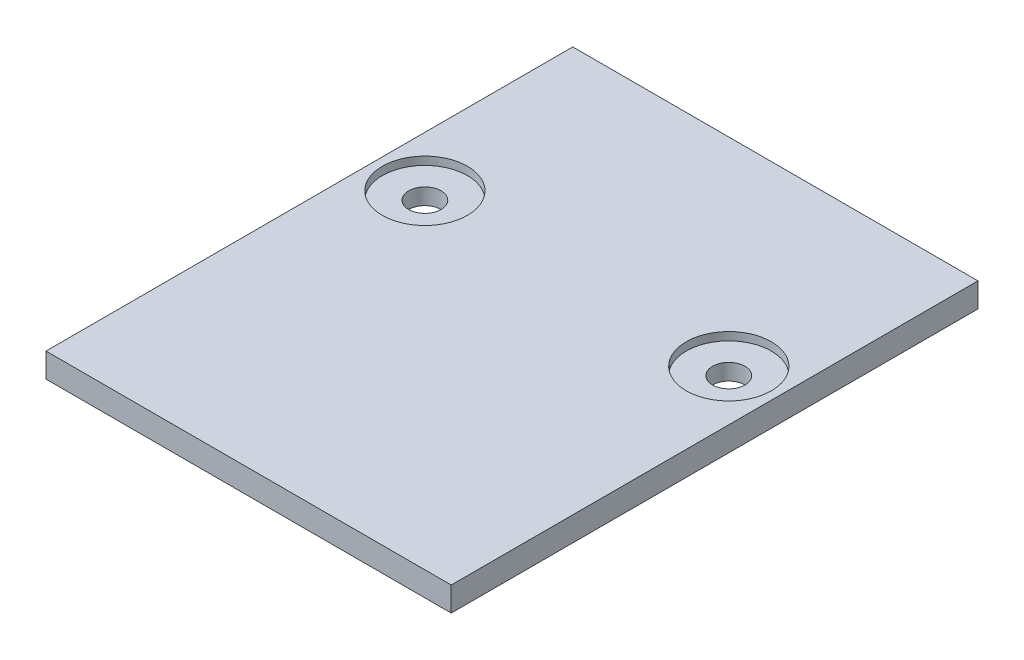
ISO-10303-21;
HEADER;
FILE_DESCRIPTION(('STEP AP214'),'2;1');
FILE_NAME('part.step','',(''),(''),'','','');
FILE_SCHEMA(('AUTOMOTIVE_DESIGN { 1 0 10303 214 1 1 1 1 }'));
ENDSEC;
DATA;
#1=APPLICATION_CONTEXT('core data for automotive mechanical design processes');
#2=APPLICATION_PROTOCOL_DEFINITION('international standard','automotive_design',2000,#1);
#3=PRODUCT_CONTEXT('',#1,'mechanical');
#4=PRODUCT('Part','Part','',(#3));
#5=PRODUCT_RELATED_PRODUCT_CATEGORY('part','',(#4));
#6=PRODUCT_DEFINITION_FORMATION('','',#4);
#7=PRODUCT_DEFINITION_CONTEXT('part definition',#1,'design');
#8=PRODUCT_DEFINITION('design','',#6,#7);
#9=PRODUCT_DEFINITION_SHAPE('','',#8);
#10=(LENGTH_UNIT() NAMED_UNIT(*) SI_UNIT(.MILLI.,.METRE.));
#11=(NAMED_UNIT(*) PLANE_ANGLE_UNIT() SI_UNIT($,.RADIAN.));
#12=(NAMED_UNIT(*) SI_UNIT($,.STERADIAN.) SOLID_ANGLE_UNIT());
#13=UNCERTAINTY_MEASURE_WITH_UNIT(LENGTH_MEASURE(1.E-05),#10,'distance_accuracy_value','');
#14=(GEOMETRIC_REPRESENTATION_CONTEXT(3) GLOBAL_UNCERTAINTY_ASSIGNED_CONTEXT((#13)) GLOBAL_UNIT_ASSIGNED_CONTEXT((#10,
#11,#12)) REPRESENTATION_CONTEXT('',''));
#15=CARTESIAN_POINT('',(0.,0.,0.));
#16=DIRECTION('',(0.,0.,1.));
#17=DIRECTION('',(1.,0.,0.));
#18=AXIS2_PLACEMENT_3D('',#15,#16,#17);
#19=CARTESIAN_POINT('',(37.5,0.,-16.));
#20=DIRECTION('',(0.,1.,0.));
#21=DIRECTION('',(0.,0.,1.));
#22=AXIS2_PLACEMENT_3D('',#19,#20,#21);
#23=CYLINDRICAL_SURFACE('',#22,4.00000000000001);
#24=CARTESIAN_POINT('',(37.5,0.,-16.));
#25=DIRECTION('',(0.,1.,0.));
#26=DIRECTION('',(0.,0.,1.));
#27=AXIS2_PLACEMENT_3D('',#24,#25,#26);
#28=CIRCLE('',#27,4.00000000000001);
#29=CARTESIAN_POINT('',(37.5,0.,-12.));
#30=VERTEX_POINT('',#29);
#31=EDGE_CURVE('E115',#30,#30,#28,.T.);
#32=ORIENTED_EDGE('',*,*,#31,.F.);
#33=EDGE_LOOP('',(#32));
#34=FACE_BOUND('',#33,.T.);
#35=CARTESIAN_POINT('',(37.5,4.,-16.));
#36=DIRECTION('',(0.,1.,0.));
#37=DIRECTION('',(0.,0.,1.));
#38=AXIS2_PLACEMENT_3D('',#35,#36,#37);
#39=CIRCLE('',#38,4.00000000000001);
#40=CARTESIAN_POINT('',(37.5,4.,-12.));
#41=VERTEX_POINT('',#40);
#42=EDGE_CURVE('E38',#41,#41,#39,.F.);
#43=ORIENTED_EDGE('',*,*,#42,.F.);
#44=EDGE_LOOP('',(#43));
#45=FACE_BOUND('',#44,.T.);
#46=ADVANCED_FACE('F34',(#34,#45),#23,.F.);
#47=CARTESIAN_POINT('',(-37.5,0.,-16.));
#48=DIRECTION('',(0.,1.,0.));
#49=DIRECTION('',(0.,0.,1.));
#50=AXIS2_PLACEMENT_3D('',#47,#48,#49);
#51=CYLINDRICAL_SURFACE('',#50,4.);
#52=CARTESIAN_POINT('',(-37.5,0.,-16.));
#53=DIRECTION('',(0.,1.,0.));
#54=DIRECTION('',(0.,0.,1.));
#55=AXIS2_PLACEMENT_3D('',#52,#53,#54);
#56=CIRCLE('',#55,4.);
#57=CARTESIAN_POINT('',(-37.5,0.,-12.));
#58=VERTEX_POINT('',#57);
#59=EDGE_CURVE('E104',#58,#58,#56,.T.);
#60=ORIENTED_EDGE('',*,*,#59,.F.);
#61=EDGE_LOOP('',(#60));
#62=FACE_BOUND('',#61,.T.);
#63=CARTESIAN_POINT('',(-37.5,4.,-16.));
#64=DIRECTION('',(0.,1.,0.));
#65=DIRECTION('',(0.,0.,1.));
#66=AXIS2_PLACEMENT_3D('',#63,#64,#65);
#67=CIRCLE('',#66,4.);
#68=CARTESIAN_POINT('',(-37.5,4.,-12.));
#69=VERTEX_POINT('',#68);
#70=EDGE_CURVE('E109',#69,#69,#67,.F.);
#71=ORIENTED_EDGE('',*,*,#70,.F.);
#72=EDGE_LOOP('',(#71));
#73=FACE_BOUND('',#72,.T.);
#74=ADVANCED_FACE('F140',(#62,#73),#51,.F.);
#75=CARTESIAN_POINT('',(50.,6.,65.));
#76=DIRECTION('',(-1.,0.,0.));
#77=DIRECTION('',(0.,0.,1.));
#78=AXIS2_PLACEMENT_3D('',#75,#76,#77);
#79=PLANE('',#78);
#80=DIRECTION('',(0.,0.,-1.));
#81=VECTOR('',#80,1.);
#82=CARTESIAN_POINT('',(50.,0.,65.));
#83=LINE('',#82,#81);
#84=CARTESIAN_POINT('',(50.,0.,65.));
#85=VERTEX_POINT('',#84);
#86=CARTESIAN_POINT('',(50.,0.,-65.));
#87=VERTEX_POINT('',#86);
#88=EDGE_CURVE('E101',#85,#87,#83,.T.);
#89=ORIENTED_EDGE('',*,*,#88,.T.);
#90=DIRECTION('',(0.,-1.,0.));
#91=VECTOR('',#90,1.);
#92=CARTESIAN_POINT('',(50.,6.,-65.));
#93=LINE('',#92,#91);
#94=CARTESIAN_POINT('',(50.,6.,-65.));
#95=VERTEX_POINT('',#94);
#96=EDGE_CURVE('E11',#95,#87,#93,.T.);
#97=ORIENTED_EDGE('',*,*,#96,.F.);
#98=DIRECTION('',(0.,0.,-1.));
#99=VECTOR('',#98,1.);
#100=CARTESIAN_POINT('',(50.,6.,65.));
#101=LINE('',#100,#99);
#102=CARTESIAN_POINT('',(50.,6.,65.));
#103=VERTEX_POINT('',#102);
#104=EDGE_CURVE('E88',#103,#95,#101,.T.);
#105=ORIENTED_EDGE('',*,*,#104,.F.);
#106=DIRECTION('',(0.,-1.,0.));
#107=VECTOR('',#106,1.);
#108=CARTESIAN_POINT('',(50.,6.,65.));
#109=LINE('',#108,#107);
#110=EDGE_CURVE('E97',#103,#85,#109,.T.);
#111=ORIENTED_EDGE('',*,*,#110,.T.);
#112=EDGE_LOOP('',(#89,#97,#105,#111));
#113=FACE_BOUND('',#112,.T.);
#114=ADVANCED_FACE('F36',(#113),#79,.F.);
#115=CARTESIAN_POINT('',(-50.,6.,-65.));
#116=DIRECTION('',(0.,0.,1.));
#117=DIRECTION('',(1.,0.,0.));
#118=AXIS2_PLACEMENT_3D('',#115,#116,#117);
#119=PLANE('',#118);
#120=DIRECTION('',(-1.,0.,0.));
#121=VECTOR('',#120,1.);
#122=CARTESIAN_POINT('',(-50.,0.,-65.));
#123=LINE('',#122,#121);
#124=CARTESIAN_POINT('',(-50.,0.,-65.));
#125=VERTEX_POINT('',#124);
#126=EDGE_CURVE('E92',#87,#125,#123,.T.);
#127=ORIENTED_EDGE('',*,*,#126,.T.);
#128=DIRECTION('',(0.,-1.,0.));
#129=VECTOR('',#128,1.);
#130=CARTESIAN_POINT('',(-50.,6.,-65.));
#131=LINE('',#130,#129);
#132=CARTESIAN_POINT('',(-50.,6.,-65.));
#133=VERTEX_POINT('',#132);
#134=EDGE_CURVE('E44',#133,#125,#131,.T.);
#135=ORIENTED_EDGE('',*,*,#134,.F.);
#136=DIRECTION('',(-1.,0.,0.));
#137=VECTOR('',#136,1.);
#138=CARTESIAN_POINT('',(-50.,6.,-65.));
#139=LINE('',#138,#137);
#140=EDGE_CURVE('E83',#95,#133,#139,.T.);
#141=ORIENTED_EDGE('',*,*,#140,.F.);
#142=ORIENTED_EDGE('',*,*,#96,.T.);
#143=EDGE_LOOP('',(#127,#135,#141,#142));
#144=FACE_BOUND('',#143,.T.);
#145=ADVANCED_FACE('F91',(#144),#119,.F.);
#146=CARTESIAN_POINT('',(-50.,6.,65.));
#147=DIRECTION('',(1.,0.,0.));
#148=DIRECTION('',(0.,0.,-1.));
#149=AXIS2_PLACEMENT_3D('',#146,#147,#148);
#150=PLANE('',#149);
#151=DIRECTION('',(0.,0.,1.));
#152=VECTOR('',#151,1.);
#153=CARTESIAN_POINT('',(-50.,0.,65.));
#154=LINE('',#153,#152);
#155=CARTESIAN_POINT('',(-50.,0.,65.));
#156=VERTEX_POINT('',#155);
#157=EDGE_CURVE('E70',#125,#156,#154,.T.);
#158=ORIENTED_EDGE('',*,*,#157,.T.);
#159=DIRECTION('',(0.,-1.,0.));
#160=VECTOR('',#159,1.);
#161=CARTESIAN_POINT('',(-50.,6.,65.));
#162=LINE('',#161,#160);
#163=CARTESIAN_POINT('',(-50.,6.,65.));
#164=VERTEX_POINT('',#163);
#165=EDGE_CURVE('E93',#164,#156,#162,.T.);
#166=ORIENTED_EDGE('',*,*,#165,.F.);
#167=DIRECTION('',(0.,0.,1.));
#168=VECTOR('',#167,1.);
#169=CARTESIAN_POINT('',(-50.,6.,65.));
#170=LINE('',#169,#168);
#171=EDGE_CURVE('E86',#133,#164,#170,.T.);
#172=ORIENTED_EDGE('',*,*,#171,.F.);
#173=ORIENTED_EDGE('',*,*,#134,.T.);
#174=EDGE_LOOP('',(#158,#166,#172,#173));
#175=FACE_BOUND('',#174,.T.);
#176=ADVANCED_FACE('F95',(#175),#150,.F.);
#177=CARTESIAN_POINT('',(-50.,6.,65.));
#178=DIRECTION('',(0.,0.,-1.));
#179=DIRECTION('',(-1.,0.,0.));
#180=AXIS2_PLACEMENT_3D('',#177,#178,#179);
#181=PLANE('',#180);
#182=DIRECTION('',(1.,0.,0.));
#183=VECTOR('',#182,1.);
#184=CARTESIAN_POINT('',(-50.,0.,65.));
#185=LINE('',#184,#183);
#186=EDGE_CURVE('E76',#156,#85,#185,.T.);
#187=ORIENTED_EDGE('',*,*,#186,.T.);
#188=ORIENTED_EDGE('',*,*,#110,.F.);
#189=DIRECTION('',(1.,0.,0.));
#190=VECTOR('',#189,1.);
#191=CARTESIAN_POINT('',(-50.,6.,65.));
#192=LINE('',#191,#190);
#193=EDGE_CURVE('E53',#164,#103,#192,.T.);
#194=ORIENTED_EDGE('',*,*,#193,.F.);
#195=ORIENTED_EDGE('',*,*,#165,.T.);
#196=EDGE_LOOP('',(#187,#188,#194,#195));
#197=FACE_BOUND('',#196,.T.);
#198=ADVANCED_FACE('F167',(#197),#181,.F.);
#199=CARTESIAN_POINT('',(0.,6.,0.));
#200=DIRECTION('',(0.,-1.,0.));
#201=DIRECTION('',(0.,0.,-1.));
#202=AXIS2_PLACEMENT_3D('',#199,#200,#201);
#203=PLANE('',#202);
#204=CARTESIAN_POINT('',(37.5,6.,-16.));
#205=DIRECTION('',(0.,1.,0.));
#206=DIRECTION('',(0.,0.,1.));
#207=AXIS2_PLACEMENT_3D('',#204,#205,#206);
#208=CIRCLE('',#207,10.5);
#209=CARTESIAN_POINT('',(37.5,6.,-5.5));
#210=VERTEX_POINT('',#209);
#211=EDGE_CURVE('E117',#210,#210,#208,.T.);
#212=ORIENTED_EDGE('',*,*,#211,.F.);
#213=EDGE_LOOP('',(#212));
#214=FACE_BOUND('',#213,.T.);
#215=CARTESIAN_POINT('',(-37.5,6.,-16.));
#216=DIRECTION('',(0.,1.,0.));
#217=DIRECTION('',(0.,0.,1.));
#218=AXIS2_PLACEMENT_3D('',#215,#216,#217);
#219=CIRCLE('',#218,10.5);
#220=CARTESIAN_POINT('',(-37.5,6.,-5.5));
#221=VERTEX_POINT('',#220);
#222=EDGE_CURVE('E127',#221,#221,#219,.T.);
#223=ORIENTED_EDGE('',*,*,#222,.F.);
#224=EDGE_LOOP('',(#223));
#225=FACE_BOUND('',#224,.T.);
#226=ORIENTED_EDGE('',*,*,#104,.T.);
#227=ORIENTED_EDGE('',*,*,#140,.T.);
#228=ORIENTED_EDGE('',*,*,#171,.T.);
#229=ORIENTED_EDGE('',*,*,#193,.T.);
#230=EDGE_LOOP('',(#226,#227,#228,#229));
#231=FACE_BOUND('',#230,.T.);
#232=ADVANCED_FACE('F84',(#214,#225,#231),#203,.F.);
#233=CARTESIAN_POINT('',(0.,0.,0.));
#234=DIRECTION('',(0.,-1.,0.));
#235=DIRECTION('',(0.,0.,-1.));
#236=AXIS2_PLACEMENT_3D('',#233,#234,#235);
#237=PLANE('',#236);
#238=ORIENTED_EDGE('',*,*,#59,.T.);
#239=EDGE_LOOP('',(#238));
#240=FACE_BOUND('',#239,.T.);
#241=ORIENTED_EDGE('',*,*,#31,.T.);
#242=EDGE_LOOP('',(#241));
#243=FACE_BOUND('',#242,.T.);
#244=ORIENTED_EDGE('',*,*,#88,.F.);
#245=ORIENTED_EDGE('',*,*,#186,.F.);
#246=ORIENTED_EDGE('',*,*,#157,.F.);
#247=ORIENTED_EDGE('',*,*,#126,.F.);
#248=EDGE_LOOP('',(#244,#245,#246,#247));
#249=FACE_BOUND('',#248,.T.);
#250=ADVANCED_FACE('F135',(#240,#243,#249),#237,.T.);
#251=CARTESIAN_POINT('',(-37.5,4.,-16.));
#252=DIRECTION('',(0.,1.,0.));
#253=DIRECTION('',(0.,0.,1.));
#254=AXIS2_PLACEMENT_3D('',#251,#252,#253);
#255=PLANE('',#254);
#256=CARTESIAN_POINT('',(-37.5,4.,-16.));
#257=DIRECTION('',(0.,1.,0.));
#258=DIRECTION('',(0.,0.,1.));
#259=AXIS2_PLACEMENT_3D('',#256,#257,#258);
#260=CIRCLE('',#259,10.5);
#261=CARTESIAN_POINT('',(-37.5,4.,-5.5));
#262=VERTEX_POINT('',#261);
#263=EDGE_CURVE('E122',#262,#262,#260,.T.);
#264=ORIENTED_EDGE('',*,*,#263,.T.);
#265=EDGE_LOOP('',(#264));
#266=FACE_BOUND('',#265,.T.);
#267=ORIENTED_EDGE('',*,*,#70,.T.);
#268=EDGE_LOOP('',(#267));
#269=FACE_BOUND('',#268,.T.);
#270=ADVANCED_FACE('F155',(#266,#269),#255,.T.);
#271=CARTESIAN_POINT('',(-37.5,4.,-16.));
#272=DIRECTION('',(0.,1.,0.));
#273=DIRECTION('',(0.,0.,1.));
#274=AXIS2_PLACEMENT_3D('',#271,#272,#273);
#275=CYLINDRICAL_SURFACE('',#274,10.5);
#276=ORIENTED_EDGE('',*,*,#263,.F.);
#277=EDGE_LOOP('',(#276));
#278=FACE_BOUND('',#277,.T.);
#279=ORIENTED_EDGE('',*,*,#222,.T.);
#280=EDGE_LOOP('',(#279));
#281=FACE_BOUND('',#280,.T.);
#282=ADVANCED_FACE('F147',(#278,#281),#275,.F.);
#283=CARTESIAN_POINT('',(37.5,4.,-16.));
#284=DIRECTION('',(0.,1.,0.));
#285=DIRECTION('',(0.,0.,1.));
#286=AXIS2_PLACEMENT_3D('',#283,#284,#285);
#287=PLANE('',#286);
#288=CARTESIAN_POINT('',(37.5,4.,-16.));
#289=DIRECTION('',(0.,1.,0.));
#290=DIRECTION('',(0.,0.,1.));
#291=AXIS2_PLACEMENT_3D('',#288,#289,#290);
#292=CIRCLE('',#291,10.5);
#293=CARTESIAN_POINT('',(37.5,4.,-5.5));
#294=VERTEX_POINT('',#293);
#295=EDGE_CURVE('E111',#294,#294,#292,.T.);
#296=ORIENTED_EDGE('',*,*,#295,.T.);
#297=EDGE_LOOP('',(#296));
#298=FACE_BOUND('',#297,.T.);
#299=ORIENTED_EDGE('',*,*,#42,.T.);
#300=EDGE_LOOP('',(#299));
#301=FACE_BOUND('',#300,.T.);
#302=ADVANCED_FACE('F144',(#298,#301),#287,.T.);
#303=CARTESIAN_POINT('',(37.5,4.,-16.));
#304=DIRECTION('',(0.,1.,0.));
#305=DIRECTION('',(0.,0.,1.));
#306=AXIS2_PLACEMENT_3D('',#303,#304,#305);
#307=CYLINDRICAL_SURFACE('',#306,10.5);
#308=ORIENTED_EDGE('',*,*,#295,.F.);
#309=EDGE_LOOP('',(#308));
#310=FACE_BOUND('',#309,.T.);
#311=ORIENTED_EDGE('',*,*,#211,.T.);
#312=EDGE_LOOP('',(#311));
#313=FACE_BOUND('',#312,.T.);
#314=ADVANCED_FACE('F146',(#310,#313),#307,.F.);
#315=CLOSED_SHELL('',(#46,#74,#114,#145,#176,#198,#232,#250,#270,#282,#302,#314));
#316=MANIFOLD_SOLID_BREP('B2',#315);
#317=ADVANCED_BREP_SHAPE_REPRESENTATION('',(#18,#316),#14);
#318=SHAPE_DEFINITION_REPRESENTATION(#9,#317);
ENDSEC;
END-ISO-10303-21;
